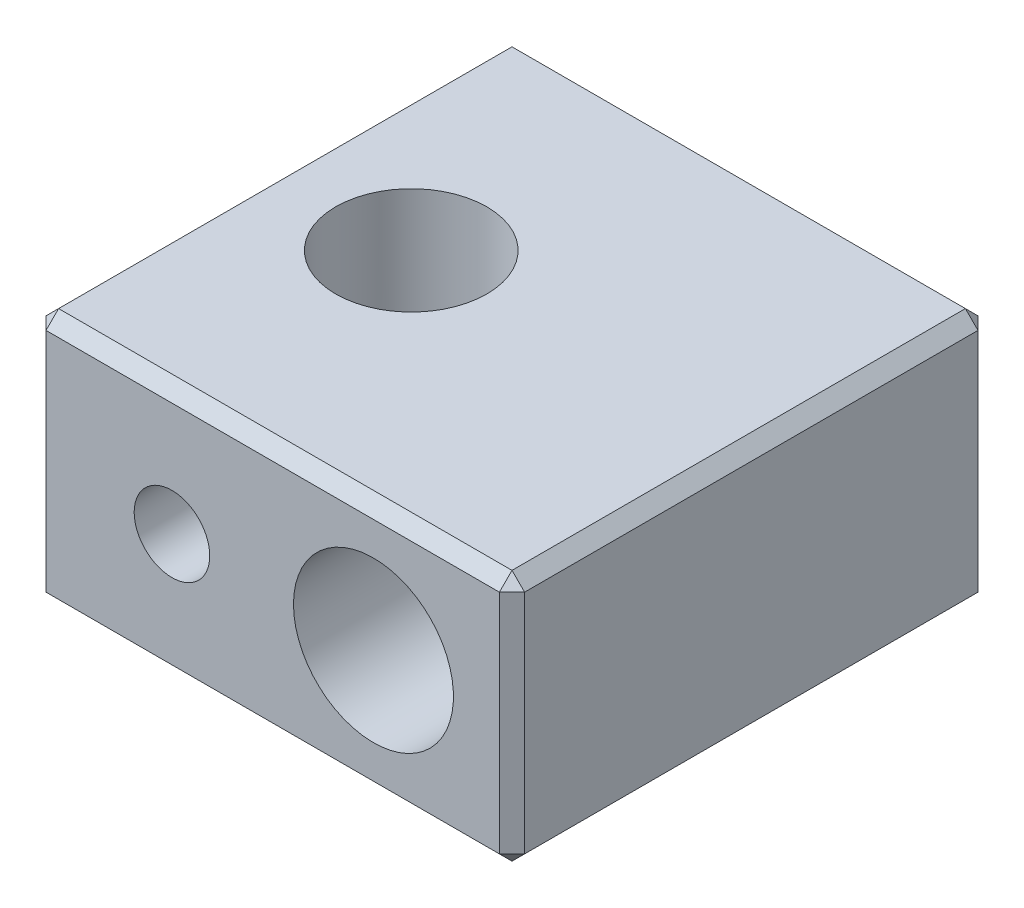
ISO-10303-21;
HEADER;
FILE_DESCRIPTION(('STEP AP214'),'2;1');
FILE_NAME('part.step','',(''),(''),'','','');
FILE_SCHEMA(('AUTOMOTIVE_DESIGN { 1 0 10303 214 1 1 1 1 }'));
ENDSEC;
DATA;
#1=APPLICATION_CONTEXT('core data for automotive mechanical design processes');
#2=APPLICATION_PROTOCOL_DEFINITION('international standard','automotive_design',2000,#1);
#3=PRODUCT_CONTEXT('',#1,'mechanical');
#4=PRODUCT('Part','Part','',(#3));
#5=PRODUCT_RELATED_PRODUCT_CATEGORY('part','',(#4));
#6=PRODUCT_DEFINITION_FORMATION('','',#4);
#7=PRODUCT_DEFINITION_CONTEXT('part definition',#1,'design');
#8=PRODUCT_DEFINITION('design','',#6,#7);
#9=PRODUCT_DEFINITION_SHAPE('','',#8);
#10=(LENGTH_UNIT() NAMED_UNIT(*) SI_UNIT(.MILLI.,.METRE.));
#11=(NAMED_UNIT(*) PLANE_ANGLE_UNIT() SI_UNIT($,.RADIAN.));
#12=(NAMED_UNIT(*) SI_UNIT($,.STERADIAN.) SOLID_ANGLE_UNIT());
#13=UNCERTAINTY_MEASURE_WITH_UNIT(LENGTH_MEASURE(1.E-05),#10,'distance_accuracy_value','');
#14=(GEOMETRIC_REPRESENTATION_CONTEXT(3) GLOBAL_UNCERTAINTY_ASSIGNED_CONTEXT((#13)) GLOBAL_UNIT_ASSIGNED_CONTEXT((#10,
#11,#12)) REPRESENTATION_CONTEXT('',''));
#15=CARTESIAN_POINT('',(0.,0.,0.));
#16=DIRECTION('',(0.,0.,1.));
#17=DIRECTION('',(1.,0.,0.));
#18=AXIS2_PLACEMENT_3D('',#15,#16,#17);
#19=CARTESIAN_POINT('',(-9.5,10.,9.5));
#20=DIRECTION('',(0.,0.,-1.));
#21=DIRECTION('',(-1.,0.,0.));
#22=AXIS2_PLACEMENT_3D('',#19,#20,#21);
#23=PLANE('',#22);
#24=DIRECTION('',(0.,-1.,0.));
#25=VECTOR('',#24,1.);
#26=CARTESIAN_POINT('',(-8.99999999999999,10.,9.5));
#27=LINE('',#26,#25);
#28=CARTESIAN_POINT('',(-8.99999999999999,9.49999999999999,9.5));
#29=VERTEX_POINT('',#28);
#30=CARTESIAN_POINT('',(-8.99999999999999,0.500000000000004,9.5));
#31=VERTEX_POINT('',#30);
#32=EDGE_CURVE('E133',#29,#31,#27,.T.);
#33=ORIENTED_EDGE('',*,*,#32,.T.);
#34=DIRECTION('',(1.,0.,0.));
#35=VECTOR('',#34,1.);
#36=CARTESIAN_POINT('',(-9.5,0.500000000000004,9.5));
#37=LINE('',#36,#35);
#38=CARTESIAN_POINT('',(8.99999999999999,0.500000000000004,9.5));
#39=VERTEX_POINT('',#38);
#40=EDGE_CURVE('E129',#31,#39,#37,.T.);
#41=ORIENTED_EDGE('',*,*,#40,.T.);
#42=DIRECTION('',(0.,1.,0.));
#43=VECTOR('',#42,1.);
#44=CARTESIAN_POINT('',(8.99999999999999,10.,9.5));
#45=LINE('',#44,#43);
#46=CARTESIAN_POINT('',(8.99999999999999,9.49999999999999,9.5));
#47=VERTEX_POINT('',#46);
#48=EDGE_CURVE('E123',#39,#47,#45,.T.);
#49=ORIENTED_EDGE('',*,*,#48,.T.);
#50=DIRECTION('',(-1.,0.,0.));
#51=VECTOR('',#50,1.);
#52=CARTESIAN_POINT('',(-9.5,9.49999999999999,9.5));
#53=LINE('',#52,#51);
#54=EDGE_CURVE('E126',#47,#29,#53,.T.);
#55=ORIENTED_EDGE('',*,*,#54,.T.);
#56=EDGE_LOOP('',(#33,#41,#49,#55));
#57=FACE_BOUND('',#56,.T.);
#58=CARTESIAN_POINT('',(4.,5.,9.5));
#59=DIRECTION('',(0.,0.,-1.));
#60=DIRECTION('',(-1.,0.,0.));
#61=AXIS2_PLACEMENT_3D('',#58,#59,#60);
#62=CIRCLE('',#61,3.175);
#63=CARTESIAN_POINT('',(0.824999999999998,5.,9.5));
#64=VERTEX_POINT('',#63);
#65=EDGE_CURVE('E226',#64,#64,#62,.T.);
#66=ORIENTED_EDGE('',*,*,#65,.T.);
#67=EDGE_LOOP('',(#66));
#68=FACE_BOUND('',#67,.T.);
#69=CARTESIAN_POINT('',(-4.,5.,9.5));
#70=DIRECTION('',(0.,0.,-1.));
#71=DIRECTION('',(-1.,0.,0.));
#72=AXIS2_PLACEMENT_3D('',#69,#70,#71);
#73=CIRCLE('',#72,1.5);
#74=CARTESIAN_POINT('',(-5.5,5.,9.5));
#75=VERTEX_POINT('',#74);
#76=EDGE_CURVE('E202',#75,#75,#73,.T.);
#77=ORIENTED_EDGE('',*,*,#76,.T.);
#78=EDGE_LOOP('',(#77));
#79=FACE_BOUND('',#78,.T.);
#80=ADVANCED_FACE('F35',(#57,#68,#79),#23,.F.);
#81=CARTESIAN_POINT('',(9.5,0.,9.5));
#82=DIRECTION('',(0.,1.,0.));
#83=DIRECTION('',(0.,0.,1.));
#84=AXIS2_PLACEMENT_3D('',#81,#82,#83);
#85=PLANE('',#84);
#86=DIRECTION('',(0.,0.,1.));
#87=VECTOR('',#86,1.);
#88=CARTESIAN_POINT('',(9.,0.,9.5));
#89=LINE('',#88,#87);
#90=CARTESIAN_POINT('',(8.99999999999999,0.,-8.99999999999999));
#91=VERTEX_POINT('',#90);
#92=CARTESIAN_POINT('',(9.,0.,8.99999999999999));
#93=VERTEX_POINT('',#92);
#94=EDGE_CURVE('E362',#91,#93,#89,.T.);
#95=ORIENTED_EDGE('',*,*,#94,.T.);
#96=DIRECTION('',(-1.,0.,0.));
#97=VECTOR('',#96,1.);
#98=CARTESIAN_POINT('',(9.5,0.,8.99999999999999));
#99=LINE('',#98,#97);
#100=CARTESIAN_POINT('',(-8.99999999999999,0.,8.99999999999999));
#101=VERTEX_POINT('',#100);
#102=EDGE_CURVE('E364',#93,#101,#99,.T.);
#103=ORIENTED_EDGE('',*,*,#102,.T.);
#104=DIRECTION('',(0.,0.,-1.));
#105=VECTOR('',#104,1.);
#106=CARTESIAN_POINT('',(-8.99999999999999,0.,9.5));
#107=LINE('',#106,#105);
#108=CARTESIAN_POINT('',(-8.99999999999999,0.,-8.99999999999999));
#109=VERTEX_POINT('',#108);
#110=EDGE_CURVE('E358',#101,#109,#107,.T.);
#111=ORIENTED_EDGE('',*,*,#110,.T.);
#112=DIRECTION('',(1.,0.,0.));
#113=VECTOR('',#112,1.);
#114=CARTESIAN_POINT('',(9.5,0.,-8.99999999999999));
#115=LINE('',#114,#113);
#116=EDGE_CURVE('E360',#109,#91,#115,.T.);
#117=ORIENTED_EDGE('',*,*,#116,.T.);
#118=EDGE_LOOP('',(#95,#103,#111,#117));
#119=FACE_BOUND('',#118,.T.);
#120=CARTESIAN_POINT('',(-4.,0.,0.));
#121=DIRECTION('',(0.,-1.,0.));
#122=DIRECTION('',(0.,0.,-1.));
#123=AXIS2_PLACEMENT_3D('',#120,#121,#122);
#124=CIRCLE('',#123,3.25);
#125=CARTESIAN_POINT('',(-4.,0.,-3.25));
#126=VERTEX_POINT('',#125);
#127=EDGE_CURVE('E428',#126,#126,#124,.T.);
#128=ORIENTED_EDGE('',*,*,#127,.F.);
#129=EDGE_LOOP('',(#128));
#130=FACE_BOUND('',#129,.T.);
#131=CARTESIAN_POINT('',(4.,0.,0.));
#132=DIRECTION('',(0.,1.,0.));
#133=DIRECTION('',(0.,0.,1.));
#134=AXIS2_PLACEMENT_3D('',#131,#132,#133);
#135=CIRCLE('',#134,1.5);
#136=CARTESIAN_POINT('',(4.,0.,1.5));
#137=VERTEX_POINT('',#136);
#138=EDGE_CURVE('E216',#137,#137,#135,.T.);
#139=ORIENTED_EDGE('',*,*,#138,.T.);
#140=EDGE_LOOP('',(#139));
#141=FACE_BOUND('',#140,.T.);
#142=ADVANCED_FACE('F247',(#119,#130,#141),#85,.F.);
#143=CARTESIAN_POINT('',(4.,5.,9.5));
#144=DIRECTION('',(0.,0.,-1.));
#145=DIRECTION('',(-1.,0.,0.));
#146=AXIS2_PLACEMENT_3D('',#143,#144,#145);
#147=CYLINDRICAL_SURFACE('',#146,3.175);
#148=CARTESIAN_POINT('',(4.,5.,-9.5));
#149=DIRECTION('',(0.,0.,-1.));
#150=DIRECTION('',(-1.,0.,0.));
#151=AXIS2_PLACEMENT_3D('',#148,#149,#150);
#152=CIRCLE('',#151,3.175);
#153=CARTESIAN_POINT('',(0.824999999999998,5.,-9.5));
#154=VERTEX_POINT('',#153);
#155=EDGE_CURVE('E219',#154,#154,#152,.T.);
#156=ORIENTED_EDGE('',*,*,#155,.T.);
#157=EDGE_LOOP('',(#156));
#158=FACE_BOUND('',#157,.T.);
#159=ORIENTED_EDGE('',*,*,#65,.F.);
#160=EDGE_LOOP('',(#159));
#161=FACE_BOUND('',#160,.T.);
#162=CARTESIAN_POINT('',(4.,1.825,-1.5));
#163=CARTESIAN_POINT('',(4.07936960563319,1.82500378014705,-1.49999552610351));
#164=CARTESIAN_POINT('',(4.15884896621332,1.82800879629186,-1.49366335348419));
#165=CARTESIAN_POINT('',(4.3154907966577,1.83973237257584,-1.46859961285751));
#166=CARTESIAN_POINT('',(4.39264787604167,1.84846329246751,-1.44984122112576));
#167=CARTESIAN_POINT('',(4.54213461401645,1.8707181485981,-1.40080463386028));
#168=CARTESIAN_POINT('',(4.61448113482697,1.88422416603307,-1.37056947468804));
#169=CARTESIAN_POINT('',(4.75298275747988,1.91476442442062,-1.29964446831745));
#170=CARTESIAN_POINT('',(4.81913879873701,1.93179812877659,-1.25895621091422));
#171=CARTESIAN_POINT('',(4.94753197755139,1.96890784997548,-1.16568662754687));
#172=CARTESIAN_POINT('',(5.00934531536299,1.98910050392611,-1.11256891765261));
#173=CARTESIAN_POINT('',(5.12356872804672,2.02983122248948,-0.997094015418057));
#174=CARTESIAN_POINT('',(5.17597245123061,2.05036951025994,-0.934730633511468));
#175=CARTESIAN_POINT('',(5.27340721108708,2.09104265788839,-0.797484364549707));
#176=CARTESIAN_POINT('',(5.31770529611402,2.11105747093378,-0.722041543144826));
#177=CARTESIAN_POINT('',(5.39279860497068,2.14649805086367,-0.563714506050773));
#178=CARTESIAN_POINT('',(5.4236026358555,2.16192680877126,-0.480835186570921));
#179=CARTESIAN_POINT('',(5.46896762087975,2.18515018476853,-0.31481732997647));
#180=CARTESIAN_POINT('',(5.48434942407678,2.19332754828801,-0.231959104586468));
#181=CARTESIAN_POINT('',(5.50096994970779,2.20217709352757,-0.0644666996695347));
#182=CARTESIAN_POINT('',(5.50222015512641,2.20285536881031,0.0201659819400645));
#183=CARTESIAN_POINT('',(5.49114871052963,2.19694406736192,0.179375308597733));
#184=CARTESIAN_POINT('',(5.48022366031689,2.19110228775897,0.254083159444344));
#185=CARTESIAN_POINT('',(5.44750469243097,2.17410342089286,0.400444680864749));
#186=CARTESIAN_POINT('',(5.42570787921159,2.16294491762807,0.472097532259387));
#187=CARTESIAN_POINT('',(5.37144042107046,2.13631288920667,0.612321457252151));
#188=CARTESIAN_POINT('',(5.33873421633754,2.12074539557425,0.680782693270601));
#189=CARTESIAN_POINT('',(5.26375034917989,2.08705518759843,0.811555770691812));
#190=CARTESIAN_POINT('',(5.22146847336964,2.06893134976761,0.873864887721362));
#191=CARTESIAN_POINT('',(5.12301829304094,2.02972032691525,0.997886017898578));
#192=CARTESIAN_POINT('',(5.06582685913967,2.00852815825586,1.05875534173549));
#193=CARTESIAN_POINT('',(4.94191165452174,1.96723030755263,1.17036692101214));
#194=CARTESIAN_POINT('',(4.87518424052315,1.94712504483319,1.22110528801275));
#195=CARTESIAN_POINT('',(4.73090045194253,1.90934186811578,1.31276553049459));
#196=CARTESIAN_POINT('',(4.65303276474939,1.89178262065809,1.3532501250906));
#197=CARTESIAN_POINT('',(4.49054980640997,1.86204103438622,1.42023485274128));
#198=CARTESIAN_POINT('',(4.40593938939462,1.84985486801759,1.44674494327945));
#199=CARTESIAN_POINT('',(4.23932533118367,1.83301150614484,1.48304672169946));
#200=CARTESIAN_POINT('',(4.15761808537237,1.82784930363547,1.49396302225133));
#201=CARTESIAN_POINT('',(3.99337993762666,1.82394625691096,1.50223450172528));
#202=CARTESIAN_POINT('',(3.91084937990857,1.82520283284867,1.49959512896601));
#203=CARTESIAN_POINT('',(3.75320909524375,1.83368749574601,1.48154104977407));
#204=CARTESIAN_POINT('',(3.67797438273671,1.84050696101403,1.46700031787886));
#205=CARTESIAN_POINT('',(3.53114008861237,1.85893750143806,1.42687253370616));
#206=CARTESIAN_POINT('',(3.45954092924452,1.87054913175455,1.40128420157562));
#207=CARTESIAN_POINT('',(3.3195173353867,1.89793370999513,1.33902722401946));
#208=CARTESIAN_POINT('',(3.25125556630968,1.91382242394619,1.30204540414419));
#209=CARTESIAN_POINT('',(3.12166658688653,1.9481715735434,1.21839457445117));
#210=CARTESIAN_POINT('',(3.06034243754656,1.9666331364222,1.17172131414348));
#211=CARTESIAN_POINT('',(2.94055528499526,2.00625152384082,1.06515983569381));
#212=CARTESIAN_POINT('',(2.88284178298482,2.02750159498701,1.00446196991745));
#213=CARTESIAN_POINT('',(2.77812417836031,2.0689892973599,0.874079956626705));
#214=CARTESIAN_POINT('',(2.73112556156511,2.08922640584945,0.804391234425825));
#215=CARTESIAN_POINT('',(2.6476822639998,2.1270157776171,0.654841394300249));
#216=CARTESIAN_POINT('',(2.6116642516864,2.14444936754207,0.574709723149408));
#217=CARTESIAN_POINT('',(2.55400203348932,2.17320495906616,0.408424263919081));
#218=CARTESIAN_POINT('',(2.53234145021053,2.18453392139114,0.322277461718732));
#219=CARTESIAN_POINT('',(2.50583444641473,2.19851851692831,0.154863402906991));
#220=CARTESIAN_POINT('',(2.49963251148815,2.20187207176707,0.0738695282686648));
#221=CARTESIAN_POINT('',(2.5004008875279,2.20145924129458,-0.0880256718279041));
#222=CARTESIAN_POINT('',(2.50736721668871,2.19769500825225,-0.168927017863447));
#223=CARTESIAN_POINT('',(2.53304452543146,2.1841789062617,-0.321861858166745));
#224=CARTESIAN_POINT('',(2.55081637100025,2.17490706922987,-0.394100315708995));
#225=CARTESIAN_POINT('',(2.59652737888882,2.15192341830404,-0.53452895410737));
#226=CARTESIAN_POINT('',(2.62446960003733,2.13821026878362,-0.6027179098565));
#227=CARTESIAN_POINT('',(2.69183834096165,2.10676566636447,-0.738110551829189));
#228=CARTESIAN_POINT('',(2.73190592465991,2.0888273778811,-0.804945969560304));
#229=CARTESIAN_POINT('',(2.82161930265931,2.05137218308055,-0.931360798184328));
#230=CARTESIAN_POINT('',(2.87126967655845,2.03185452458563,-0.990936717479633));
#231=CARTESIAN_POINT('',(2.98481054622897,1.99101051160812,-1.1075560784686));
#232=CARTESIAN_POINT('',(3.04964445909147,1.96970684763495,-1.16369381341707));
#233=CARTESIAN_POINT('',(3.18849355379877,1.92960939228646,-1.26444175427494));
#234=CARTESIAN_POINT('',(3.26251314986984,1.91081681670608,-1.30904638589811));
#235=CARTESIAN_POINT('',(3.41768967664033,1.87785196490441,-1.3850463197749));
#236=CARTESIAN_POINT('',(3.49882070475343,1.86366373894684,-1.41648733383919));
#237=CARTESIAN_POINT('',(3.66595879751047,1.84150449210771,-1.46490242402554));
#238=CARTESIAN_POINT('',(3.7519506429211,1.83351510637885,-1.48191924759625));
#239=CARTESIAN_POINT('',(3.86555067251037,1.82773333825557,-1.49420643339842));
#240=CARTESIAN_POINT('',(3.89238024918377,1.82671048291779,-1.49637655199677));
#241=CARTESIAN_POINT('',(3.94613566805403,1.82534316483504,-1.49927411038089));
#242=CARTESIAN_POINT('',(3.97306151235319,1.82499871699697,-1.50000151846547));
#243=CARTESIAN_POINT('',(4.,1.825,-1.5));
#244=B_SPLINE_CURVE_WITH_KNOTS('',3,(#162,#163,#164,#165,#166,#167,#168,#169,#170,#171,#172,
#173,#174,#175,#176,#177,#178,#179,#180,#181,#182,#183,#184,#185,#186,#187,#188,#189,#190,#191,
#192,#193,#194,#195,#196,#197,#198,#199,#200,#201,#202,#203,#204,#205,#206,#207,#208,#209,#210,
#211,#212,#213,#214,#215,#216,#217,#218,#219,#220,#221,#222,#223,#224,#225,#226,#227,#228,#229,
#230,#231,#232,#233,#234,#235,#236,#237,#238,#239,#240,#241,#242,#243),.UNSPECIFIED.,.T.,.F.,(4,
2,2,2,2,2,2,2,2,2,2,2,2,2,2,2,2,2,2,2,2,2,2,2,2,2,2,2,2,2,2,2,2,2,2,2,2,2,2,2,4),(0.,
0.237998863435127,0.476513162034361,0.714141760487185,0.951734239756924,1.202566267352,
1.45356698050229,1.72144991719773,1.98915775546694,2.24170968929963,2.4940563909499,
2.72018464462581,2.94637315667184,3.17780125644152,3.40933138528568,3.66670059385932,
3.92416839616743,4.19124985366182,4.45814074508092,4.70459764976704,4.9509555058397,
5.18069145066332,5.41045401730286,5.6472008989094,5.88405183355053,6.14213867221335,
6.40035735120202,6.66760822573517,6.93455372246492,7.17710763594646,7.41958821796887,
7.64352093670395,7.86752106087492,8.10644389425159,8.34548119240929,8.60934561245708,
8.87333732850241,9.13640455025375,9.39868939422999,9.47946576344206,9.56024390756228),.UNSPECIFIED.);
#245=CARTESIAN_POINT('',(4.,1.825,-1.5));
#246=VERTEX_POINT('',#245);
#247=EDGE_CURVE('E213',#246,#246,#244,.T.);
#248=ORIENTED_EDGE('',*,*,#247,.T.);
#249=EDGE_LOOP('',(#248));
#250=FACE_BOUND('',#249,.T.);
#251=ADVANCED_FACE('F252',(#158,#161,#250),#147,.F.);
#252=CARTESIAN_POINT('',(-4.,10.,0.));
#253=DIRECTION('',(0.,-1.,0.));
#254=DIRECTION('',(0.,0.,-1.));
#255=AXIS2_PLACEMENT_3D('',#252,#253,#254);
#256=CYLINDRICAL_SURFACE('',#255,3.);
#257=CARTESIAN_POINT('',(-4.,10.,0.));
#258=DIRECTION('',(0.,1.,0.));
#259=DIRECTION('',(0.,0.,1.));
#260=AXIS2_PLACEMENT_3D('',#257,#258,#259);
#261=CIRCLE('',#260,3.);
#262=CARTESIAN_POINT('',(-4.,10.,3.));
#263=VERTEX_POINT('',#262);
#264=EDGE_CURVE('E144',#263,#263,#261,.T.);
#265=ORIENTED_EDGE('',*,*,#264,.T.);
#266=EDGE_LOOP('',(#265));
#267=FACE_BOUND('',#266,.T.);
#268=CARTESIAN_POINT('',(-4.,1.5,0.));
#269=DIRECTION('',(0.,-1.,0.));
#270=DIRECTION('',(0.,0.,-1.));
#271=AXIS2_PLACEMENT_3D('',#268,#269,#270);
#272=CIRCLE('',#271,3.);
#273=CARTESIAN_POINT('',(-4.,1.5,-3.));
#274=VERTEX_POINT('',#273);
#275=EDGE_CURVE('E433',#274,#274,#272,.T.);
#276=ORIENTED_EDGE('',*,*,#275,.T.);
#277=EDGE_LOOP('',(#276));
#278=FACE_BOUND('',#277,.T.);
#279=ADVANCED_FACE('F440',(#267,#278),#256,.F.);
#280=CARTESIAN_POINT('',(9.5,10.,9.5));
#281=DIRECTION('',(0.,1.,0.));
#282=DIRECTION('',(0.,0.,1.));
#283=AXIS2_PLACEMENT_3D('',#280,#281,#282);
#284=PLANE('',#283);
#285=DIRECTION('',(0.,0.,-1.));
#286=VECTOR('',#285,1.);
#287=CARTESIAN_POINT('',(9.,10.,-9.5));
#288=LINE('',#287,#286);
#289=CARTESIAN_POINT('',(9.,10.,9.));
#290=VERTEX_POINT('',#289);
#291=CARTESIAN_POINT('',(9.,10.,-8.99999999999999));
#292=VERTEX_POINT('',#291);
#293=EDGE_CURVE('E44',#290,#292,#288,.T.);
#294=ORIENTED_EDGE('',*,*,#293,.T.);
#295=DIRECTION('',(-1.,0.,0.));
#296=VECTOR('',#295,1.);
#297=CARTESIAN_POINT('',(-9.5,10.,-8.99999999999999));
#298=LINE('',#297,#296);
#299=CARTESIAN_POINT('',(-8.99999999999999,10.,-8.99999999999999));
#300=VERTEX_POINT('',#299);
#301=EDGE_CURVE('E11',#292,#300,#298,.T.);
#302=ORIENTED_EDGE('',*,*,#301,.T.);
#303=DIRECTION('',(0.,0.,1.));
#304=VECTOR('',#303,1.);
#305=CARTESIAN_POINT('',(-8.99999999999999,10.,9.5));
#306=LINE('',#305,#304);
#307=CARTESIAN_POINT('',(-8.99999999999999,10.,9.));
#308=VERTEX_POINT('',#307);
#309=EDGE_CURVE('E343',#300,#308,#306,.T.);
#310=ORIENTED_EDGE('',*,*,#309,.T.);
#311=DIRECTION('',(1.,0.,0.));
#312=VECTOR('',#311,1.);
#313=CARTESIAN_POINT('',(9.5,10.,9.));
#314=LINE('',#313,#312);
#315=EDGE_CURVE('E55',#308,#290,#314,.T.);
#316=ORIENTED_EDGE('',*,*,#315,.T.);
#317=EDGE_LOOP('',(#294,#302,#310,#316));
#318=FACE_BOUND('',#317,.T.);
#319=ORIENTED_EDGE('',*,*,#264,.F.);
#320=EDGE_LOOP('',(#319));
#321=FACE_BOUND('',#320,.T.);
#322=ADVANCED_FACE('F269',(#318,#321),#284,.T.);
#323=CARTESIAN_POINT('',(9.5,10.,-9.5));
#324=DIRECTION('',(-1.,0.,0.));
#325=DIRECTION('',(0.,0.,1.));
#326=AXIS2_PLACEMENT_3D('',#323,#324,#325);
#327=PLANE('',#326);
#328=DIRECTION('',(0.,-1.,0.));
#329=VECTOR('',#328,1.);
#330=CARTESIAN_POINT('',(9.5,10.,9.));
#331=LINE('',#330,#329);
#332=CARTESIAN_POINT('',(9.5,9.49999999999999,9.));
#333=VERTEX_POINT('',#332);
#334=CARTESIAN_POINT('',(9.5,0.500000000000004,9.));
#335=VERTEX_POINT('',#334);
#336=EDGE_CURVE('E155',#333,#335,#331,.T.);
#337=ORIENTED_EDGE('',*,*,#336,.T.);
#338=DIRECTION('',(0.,0.,-1.));
#339=VECTOR('',#338,1.);
#340=CARTESIAN_POINT('',(9.5,0.500000000000004,-9.5));
#341=LINE('',#340,#339);
#342=CARTESIAN_POINT('',(9.5,0.500000000000004,-8.99999999999999));
#343=VERTEX_POINT('',#342);
#344=EDGE_CURVE('E372',#335,#343,#341,.T.);
#345=ORIENTED_EDGE('',*,*,#344,.T.);
#346=DIRECTION('',(0.,1.,0.));
#347=VECTOR('',#346,1.);
#348=CARTESIAN_POINT('',(9.5,10.,-8.99999999999999));
#349=LINE('',#348,#347);
#350=CARTESIAN_POINT('',(9.5,9.49999999999999,-8.99999999999999));
#351=VERTEX_POINT('',#350);
#352=EDGE_CURVE('E370',#343,#351,#349,.T.);
#353=ORIENTED_EDGE('',*,*,#352,.T.);
#354=DIRECTION('',(0.,0.,1.));
#355=VECTOR('',#354,1.);
#356=CARTESIAN_POINT('',(9.5,9.49999999999999,9.5));
#357=LINE('',#356,#355);
#358=EDGE_CURVE('E367',#351,#333,#357,.T.);
#359=ORIENTED_EDGE('',*,*,#358,.T.);
#360=EDGE_LOOP('',(#337,#345,#353,#359));
#361=FACE_BOUND('',#360,.T.);
#362=ADVANCED_FACE('F265',(#361),#327,.F.);
#363=CARTESIAN_POINT('',(-9.5,10.,-9.5));
#364=DIRECTION('',(0.,0.,1.));
#365=DIRECTION('',(1.,0.,0.));
#366=AXIS2_PLACEMENT_3D('',#363,#364,#365);
#367=PLANE('',#366);
#368=DIRECTION('',(0.,-1.,0.));
#369=VECTOR('',#368,1.);
#370=CARTESIAN_POINT('',(9.,10.,-9.5));
#371=LINE('',#370,#369);
#372=CARTESIAN_POINT('',(9.,9.49999999999999,-9.5));
#373=VERTEX_POINT('',#372);
#374=CARTESIAN_POINT('',(9.,0.500000000000004,-9.5));
#375=VERTEX_POINT('',#374);
#376=EDGE_CURVE('E376',#373,#375,#371,.T.);
#377=ORIENTED_EDGE('',*,*,#376,.T.);
#378=DIRECTION('',(-1.,0.,0.));
#379=VECTOR('',#378,1.);
#380=CARTESIAN_POINT('',(-9.5,0.500000000000004,-9.5));
#381=LINE('',#380,#379);
#382=CARTESIAN_POINT('',(-9.,0.500000000000004,-9.5));
#383=VERTEX_POINT('',#382);
#384=EDGE_CURVE('E380',#375,#383,#381,.T.);
#385=ORIENTED_EDGE('',*,*,#384,.T.);
#386=DIRECTION('',(0.,1.,0.));
#387=VECTOR('',#386,1.);
#388=CARTESIAN_POINT('',(-9.,10.,-9.5));
#389=LINE('',#388,#387);
#390=CARTESIAN_POINT('',(-9.,9.49999999999999,-9.5));
#391=VERTEX_POINT('',#390);
#392=EDGE_CURVE('E378',#383,#391,#389,.T.);
#393=ORIENTED_EDGE('',*,*,#392,.T.);
#394=DIRECTION('',(1.,0.,0.));
#395=VECTOR('',#394,1.);
#396=CARTESIAN_POINT('',(9.5,9.49999999999999,-9.5));
#397=LINE('',#396,#395);
#398=EDGE_CURVE('E341',#391,#373,#397,.T.);
#399=ORIENTED_EDGE('',*,*,#398,.T.);
#400=EDGE_LOOP('',(#377,#385,#393,#399));
#401=FACE_BOUND('',#400,.T.);
#402=ORIENTED_EDGE('',*,*,#155,.F.);
#403=EDGE_LOOP('',(#402));
#404=FACE_BOUND('',#403,.T.);
#405=ADVANCED_FACE('F261',(#401,#404),#367,.F.);
#406=CARTESIAN_POINT('',(-9.5,10.,-9.5));
#407=DIRECTION('',(1.,0.,0.));
#408=DIRECTION('',(0.,0.,-1.));
#409=AXIS2_PLACEMENT_3D('',#406,#407,#408);
#410=PLANE('',#409);
#411=DIRECTION('',(0.,-1.,0.));
#412=VECTOR('',#411,1.);
#413=CARTESIAN_POINT('',(-9.5,10.,-8.99999999999999));
#414=LINE('',#413,#412);
#415=CARTESIAN_POINT('',(-9.5,9.49999999999999,-8.99999999999999));
#416=VERTEX_POINT('',#415);
#417=CARTESIAN_POINT('',(-9.5,0.500000000000007,-8.99999999999999));
#418=VERTEX_POINT('',#417);
#419=EDGE_CURVE('E386',#416,#418,#414,.T.);
#420=ORIENTED_EDGE('',*,*,#419,.T.);
#421=DIRECTION('',(0.,0.,1.));
#422=VECTOR('',#421,1.);
#423=CARTESIAN_POINT('',(-9.5,0.500000000000007,-9.5));
#424=LINE('',#423,#422);
#425=CARTESIAN_POINT('',(-9.5,0.500000000000007,8.99999999999999));
#426=VERTEX_POINT('',#425);
#427=EDGE_CURVE('E345',#418,#426,#424,.T.);
#428=ORIENTED_EDGE('',*,*,#427,.T.);
#429=DIRECTION('',(0.,1.,0.));
#430=VECTOR('',#429,1.);
#431=CARTESIAN_POINT('',(-9.5,10.,8.99999999999999));
#432=LINE('',#431,#430);
#433=CARTESIAN_POINT('',(-9.5,9.49999999999999,8.99999999999999));
#434=VERTEX_POINT('',#433);
#435=EDGE_CURVE('E384',#426,#434,#432,.T.);
#436=ORIENTED_EDGE('',*,*,#435,.T.);
#437=DIRECTION('',(0.,0.,-1.));
#438=VECTOR('',#437,1.);
#439=CARTESIAN_POINT('',(-9.5,9.49999999999999,-9.5));
#440=LINE('',#439,#438);
#441=EDGE_CURVE('E348',#434,#416,#440,.T.);
#442=ORIENTED_EDGE('',*,*,#441,.T.);
#443=EDGE_LOOP('',(#420,#428,#436,#442));
#444=FACE_BOUND('',#443,.T.);
#445=ADVANCED_FACE('F257',(#444),#410,.F.);
#446=CARTESIAN_POINT('',(-4.,1.5,0.));
#447=DIRECTION('',(0.,-1.,0.));
#448=DIRECTION('',(0.,0.,-1.));
#449=AXIS2_PLACEMENT_3D('',#446,#447,#448);
#450=CYLINDRICAL_SURFACE('',#449,3.25);
#451=CARTESIAN_POINT('',(-4.,1.5,0.));
#452=DIRECTION('',(0.,-1.,0.));
#453=DIRECTION('',(0.,0.,-1.));
#454=AXIS2_PLACEMENT_3D('',#451,#452,#453);
#455=CIRCLE('',#454,3.25);
#456=CARTESIAN_POINT('',(-4.,1.5,-3.25));
#457=VERTEX_POINT('',#456);
#458=EDGE_CURVE('E430',#457,#457,#455,.T.);
#459=ORIENTED_EDGE('',*,*,#458,.F.);
#460=EDGE_LOOP('',(#459));
#461=FACE_BOUND('',#460,.T.);
#462=ORIENTED_EDGE('',*,*,#127,.T.);
#463=EDGE_LOOP('',(#462));
#464=FACE_BOUND('',#463,.T.);
#465=ADVANCED_FACE('F260',(#461,#464),#450,.F.);
#466=CARTESIAN_POINT('',(-4.,1.5,0.));
#467=DIRECTION('',(0.,-1.,0.));
#468=DIRECTION('',(0.,0.,-1.));
#469=AXIS2_PLACEMENT_3D('',#466,#467,#468);
#470=PLANE('',#469);
#471=ORIENTED_EDGE('',*,*,#275,.F.);
#472=EDGE_LOOP('',(#471));
#473=FACE_BOUND('',#472,.T.);
#474=ORIENTED_EDGE('',*,*,#458,.T.);
#475=EDGE_LOOP('',(#474));
#476=FACE_BOUND('',#475,.T.);
#477=ADVANCED_FACE('F442',(#473,#476),#470,.T.);
#478=CARTESIAN_POINT('',(4.,10.001,0.));
#479=DIRECTION('',(0.,-1.,0.));
#480=DIRECTION('',(0.,0.,-1.));
#481=AXIS2_PLACEMENT_3D('',#478,#479,#480);
#482=CYLINDRICAL_SURFACE('',#481,1.5);
#483=ORIENTED_EDGE('',*,*,#138,.F.);
#484=EDGE_LOOP('',(#483));
#485=FACE_BOUND('',#484,.T.);
#486=ORIENTED_EDGE('',*,*,#247,.F.);
#487=EDGE_LOOP('',(#486));
#488=FACE_BOUND('',#487,.T.);
#489=ADVANCED_FACE('F228',(#485,#488),#482,.F.);
#490=CARTESIAN_POINT('',(-4.,5.,4.5));
#491=DIRECTION('',(0.,0.,1.));
#492=DIRECTION('',(1.,0.,0.));
#493=AXIS2_PLACEMENT_3D('',#490,#491,#492);
#494=CYLINDRICAL_SURFACE('',#493,1.5);
#495=CARTESIAN_POINT('',(-4.,5.,4.5));
#496=DIRECTION('',(0.,0.,-1.));
#497=DIRECTION('',(-1.,0.,0.));
#498=AXIS2_PLACEMENT_3D('',#495,#496,#497);
#499=CIRCLE('',#498,1.5);
#500=CARTESIAN_POINT('',(-5.5,5.,4.5));
#501=VERTEX_POINT('',#500);
#502=EDGE_CURVE('E208',#501,#501,#499,.T.);
#503=ORIENTED_EDGE('',*,*,#502,.T.);
#504=EDGE_LOOP('',(#503));
#505=FACE_BOUND('',#504,.T.);
#506=ORIENTED_EDGE('',*,*,#76,.F.);
#507=EDGE_LOOP('',(#506));
#508=FACE_BOUND('',#507,.T.);
#509=ADVANCED_FACE('F233',(#505,#508),#494,.F.);
#510=CARTESIAN_POINT('',(-4.,5.,4.5));
#511=DIRECTION('',(0.,0.,-1.));
#512=DIRECTION('',(-1.,0.,0.));
#513=AXIS2_PLACEMENT_3D('',#510,#511,#512);
#514=PLANE('',#513);
#515=ORIENTED_EDGE('',*,*,#502,.F.);
#516=EDGE_LOOP('',(#515));
#517=FACE_BOUND('',#516,.T.);
#518=ADVANCED_FACE('F236',(#517),#514,.F.);
#519=CARTESIAN_POINT('',(9.5,10.,-8.99999999999999));
#520=DIRECTION('',(0.,0.707106781186546,-0.707106781186549));
#521=DIRECTION('',(0.,0.707106781186549,0.707106781186546));
#522=AXIS2_PLACEMENT_3D('',#519,#520,#521);
#523=PLANE('',#522);
#524=DIRECTION('',(0.,-0.707106781186549,-0.707106781186546));
#525=VECTOR('',#524,1.);
#526=CARTESIAN_POINT('',(-9.,9.49999999999999,-9.5));
#527=LINE('',#526,#525);
#528=EDGE_CURVE('E39',#300,#391,#527,.T.);
#529=ORIENTED_EDGE('',*,*,#528,.F.);
#530=ORIENTED_EDGE('',*,*,#301,.F.);
#531=DIRECTION('',(0.,0.707106781186549,0.707106781186546));
#532=VECTOR('',#531,1.);
#533=CARTESIAN_POINT('',(9.,9.75,-9.24999999999999));
#534=LINE('',#533,#532);
#535=EDGE_CURVE('E195',#373,#292,#534,.T.);
#536=ORIENTED_EDGE('',*,*,#535,.F.);
#537=ORIENTED_EDGE('',*,*,#398,.F.);
#538=EDGE_LOOP('',(#529,#530,#536,#537));
#539=FACE_BOUND('',#538,.T.);
#540=ADVANCED_FACE('F37',(#539),#523,.T.);
#541=CARTESIAN_POINT('',(-9.,9.49999999999999,-9.5));
#542=DIRECTION('',(-0.577350269189628,0.577350269189626,-0.577350269189624));
#543=DIRECTION('',(-0.707106781186546,-0.707106781186549,0.));
#544=AXIS2_PLACEMENT_3D('',#541,#542,#543);
#545=PLANE('',#544);
#546=DIRECTION('',(0.707106781186548,0.707106781186548,0.));
#547=VECTOR('',#546,1.);
#548=CARTESIAN_POINT('',(-9.25,9.75,-8.99999999999999));
#549=LINE('',#548,#547);
#550=EDGE_CURVE('E190',#300,#416,#549,.F.);
#551=ORIENTED_EDGE('',*,*,#550,.F.);
#552=ORIENTED_EDGE('',*,*,#528,.T.);
#553=DIRECTION('',(0.707106781186545,0.,-0.70710678118655));
#554=VECTOR('',#553,1.);
#555=CARTESIAN_POINT('',(-9.,9.49999999999999,-9.5));
#556=LINE('',#555,#554);
#557=EDGE_CURVE('E193',#416,#391,#556,.T.);
#558=ORIENTED_EDGE('',*,*,#557,.F.);
#559=EDGE_LOOP('',(#551,#552,#558));
#560=FACE_BOUND('',#559,.T.);
#561=ADVANCED_FACE('F243',(#560),#545,.T.);
#562=CARTESIAN_POINT('',(9.5,9.49999999999999,-8.99999999999999));
#563=DIRECTION('',(0.57735026918963,0.577350269189622,-0.577350269189626));
#564=DIRECTION('',(-0.707106781186545,0.,-0.70710678118655));
#565=AXIS2_PLACEMENT_3D('',#562,#563,#564);
#566=PLANE('',#565);
#567=DIRECTION('',(0.707106781186545,0.,0.70710678118655));
#568=VECTOR('',#567,1.);
#569=CARTESIAN_POINT('',(9.5,9.49999999999999,-8.99999999999999));
#570=LINE('',#569,#568);
#571=EDGE_CURVE('E184',#373,#351,#570,.T.);
#572=ORIENTED_EDGE('',*,*,#571,.F.);
#573=ORIENTED_EDGE('',*,*,#535,.T.);
#574=DIRECTION('',(0.707106781186544,-0.707106781186551,0.));
#575=VECTOR('',#574,1.);
#576=CARTESIAN_POINT('',(9.5,9.49999999999999,-8.99999999999999));
#577=LINE('',#576,#575);
#578=EDGE_CURVE('E187',#351,#292,#577,.F.);
#579=ORIENTED_EDGE('',*,*,#578,.F.);
#580=EDGE_LOOP('',(#572,#573,#579));
#581=FACE_BOUND('',#580,.T.);
#582=ADVANCED_FACE('F332',(#581),#566,.T.);
#583=CARTESIAN_POINT('',(-9.5,10.,-8.99999999999999));
#584=DIRECTION('',(0.70710678118655,0.,0.707106781186545));
#585=DIRECTION('',(0.707106781186545,0.,-0.70710678118655));
#586=AXIS2_PLACEMENT_3D('',#583,#584,#585);
#587=PLANE('',#586);
#588=ORIENTED_EDGE('',*,*,#557,.T.);
#589=ORIENTED_EDGE('',*,*,#392,.F.);
#590=DIRECTION('',(-0.707106781186545,0.,0.70710678118655));
#591=VECTOR('',#590,1.);
#592=CARTESIAN_POINT('',(-9.,0.500000000000004,-9.5));
#593=LINE('',#592,#591);
#594=EDGE_CURVE('E179',#418,#383,#593,.F.);
#595=ORIENTED_EDGE('',*,*,#594,.F.);
#596=ORIENTED_EDGE('',*,*,#419,.F.);
#597=EDGE_LOOP('',(#588,#589,#595,#596));
#598=FACE_BOUND('',#597,.T.);
#599=ADVANCED_FACE('F328',(#598),#587,.F.);
#600=CARTESIAN_POINT('',(-8.99999999999999,10.,9.5));
#601=DIRECTION('',(-0.707106781186547,0.707106781186547,0.));
#602=DIRECTION('',(-0.707106781186548,-0.707106781186548,0.));
#603=AXIS2_PLACEMENT_3D('',#600,#601,#602);
#604=PLANE('',#603);
#605=ORIENTED_EDGE('',*,*,#550,.T.);
#606=ORIENTED_EDGE('',*,*,#441,.F.);
#607=DIRECTION('',(-0.707106781186547,-0.707106781186547,0.));
#608=VECTOR('',#607,1.);
#609=CARTESIAN_POINT('',(-9.5,9.49999999999999,8.99999999999999));
#610=LINE('',#609,#608);
#611=EDGE_CURVE('E176',#308,#434,#610,.T.);
#612=ORIENTED_EDGE('',*,*,#611,.F.);
#613=ORIENTED_EDGE('',*,*,#309,.F.);
#614=EDGE_LOOP('',(#605,#606,#612,#613));
#615=FACE_BOUND('',#614,.T.);
#616=ADVANCED_FACE('F325',(#615),#604,.T.);
#617=CARTESIAN_POINT('',(9.5,10.,9.));
#618=DIRECTION('',(0.,0.707106781186545,0.70710678118655));
#619=DIRECTION('',(0.,-0.70710678118655,0.707106781186545));
#620=AXIS2_PLACEMENT_3D('',#617,#618,#619);
#621=PLANE('',#620);
#622=DIRECTION('',(0.,-0.70710678118655,0.707106781186545));
#623=VECTOR('',#622,1.);
#624=CARTESIAN_POINT('',(8.99999999999999,9.49999999999999,9.5));
#625=LINE('',#624,#623);
#626=EDGE_CURVE('E139',#290,#47,#625,.T.);
#627=ORIENTED_EDGE('',*,*,#626,.F.);
#628=ORIENTED_EDGE('',*,*,#315,.F.);
#629=DIRECTION('',(0.,0.70710678118655,-0.707106781186545));
#630=VECTOR('',#629,1.);
#631=CARTESIAN_POINT('',(-8.99999999999999,9.74999999999999,9.25));
#632=LINE('',#631,#630);
#633=EDGE_CURVE('E142',#29,#308,#632,.T.);
#634=ORIENTED_EDGE('',*,*,#633,.F.);
#635=ORIENTED_EDGE('',*,*,#54,.F.);
#636=EDGE_LOOP('',(#627,#628,#634,#635));
#637=FACE_BOUND('',#636,.T.);
#638=ADVANCED_FACE('F138',(#637),#621,.T.);
#639=CARTESIAN_POINT('',(9.,10.,9.5));
#640=DIRECTION('',(0.707106781186551,0.707106781186544,0.));
#641=DIRECTION('',(-0.707106781186544,0.707106781186551,0.));
#642=AXIS2_PLACEMENT_3D('',#639,#640,#641);
#643=PLANE('',#642);
#644=ORIENTED_EDGE('',*,*,#578,.T.);
#645=ORIENTED_EDGE('',*,*,#293,.F.);
#646=DIRECTION('',(-0.707106781186544,0.707106781186551,0.));
#647=VECTOR('',#646,1.);
#648=CARTESIAN_POINT('',(9.25,9.75,9.));
#649=LINE('',#648,#647);
#650=EDGE_CURVE('E152',#333,#290,#649,.T.);
#651=ORIENTED_EDGE('',*,*,#650,.F.);
#652=ORIENTED_EDGE('',*,*,#358,.F.);
#653=EDGE_LOOP('',(#644,#645,#651,#652));
#654=FACE_BOUND('',#653,.T.);
#655=ADVANCED_FACE('F318',(#654),#643,.T.);
#656=CARTESIAN_POINT('',(9.,10.,-9.5));
#657=DIRECTION('',(-0.70710678118655,0.,0.707106781186545));
#658=DIRECTION('',(0.707106781186545,0.,0.70710678118655));
#659=AXIS2_PLACEMENT_3D('',#656,#657,#658);
#660=PLANE('',#659);
#661=ORIENTED_EDGE('',*,*,#571,.T.);
#662=ORIENTED_EDGE('',*,*,#352,.F.);
#663=DIRECTION('',(-0.707106781186545,0.,-0.70710678118655));
#664=VECTOR('',#663,1.);
#665=CARTESIAN_POINT('',(9.5,0.500000000000004,-8.99999999999999));
#666=LINE('',#665,#664);
#667=EDGE_CURVE('E171',#375,#343,#666,.F.);
#668=ORIENTED_EDGE('',*,*,#667,.F.);
#669=ORIENTED_EDGE('',*,*,#376,.F.);
#670=EDGE_LOOP('',(#661,#662,#668,#669));
#671=FACE_BOUND('',#670,.T.);
#672=ADVANCED_FACE('F314',(#671),#660,.F.);
#673=CARTESIAN_POINT('',(-9.5,0.500000000000004,-9.5));
#674=DIRECTION('',(0.,0.707106781186554,0.707106781186541));
#675=DIRECTION('',(0.,-0.707106781186541,0.707106781186554));
#676=AXIS2_PLACEMENT_3D('',#673,#674,#675);
#677=PLANE('',#676);
#678=DIRECTION('',(0.,0.707106781186541,-0.707106781186554));
#679=VECTOR('',#678,1.);
#680=CARTESIAN_POINT('',(-9.,0.500000000000004,-9.5));
#681=LINE('',#680,#679);
#682=EDGE_CURVE('E181',#383,#109,#681,.F.);
#683=ORIENTED_EDGE('',*,*,#682,.F.);
#684=ORIENTED_EDGE('',*,*,#384,.F.);
#685=DIRECTION('',(0.,-0.707106781186541,0.707106781186554));
#686=VECTOR('',#685,1.);
#687=CARTESIAN_POINT('',(9.,0.250000000000001,-9.24999999999999));
#688=LINE('',#687,#686);
#689=EDGE_CURVE('E168',#91,#375,#688,.F.);
#690=ORIENTED_EDGE('',*,*,#689,.F.);
#691=ORIENTED_EDGE('',*,*,#116,.F.);
#692=EDGE_LOOP('',(#683,#684,#690,#691));
#693=FACE_BOUND('',#692,.T.);
#694=ADVANCED_FACE('F310',(#693),#677,.F.);
#695=CARTESIAN_POINT('',(-9.,0.500000000000004,-9.5));
#696=DIRECTION('',(-0.577350269189626,-0.577350269189632,-0.577350269189618));
#697=DIRECTION('',(0.707106781186551,-0.707106781186544,0.));
#698=AXIS2_PLACEMENT_3D('',#695,#696,#697);
#699=PLANE('',#698);
#700=ORIENTED_EDGE('',*,*,#594,.T.);
#701=ORIENTED_EDGE('',*,*,#682,.T.);
#702=DIRECTION('',(0.707106781186548,-0.707106781186548,0.));
#703=VECTOR('',#702,1.);
#704=CARTESIAN_POINT('',(-9.25,0.250000000000006,-8.99999999999999));
#705=LINE('',#704,#703);
#706=EDGE_CURVE('E160',#418,#109,#705,.T.);
#707=ORIENTED_EDGE('',*,*,#706,.F.);
#708=EDGE_LOOP('',(#700,#701,#707));
#709=FACE_BOUND('',#708,.T.);
#710=ADVANCED_FACE('F306',(#709),#699,.T.);
#711=CARTESIAN_POINT('',(-9.5,9.49999999999999,8.99999999999999));
#712=DIRECTION('',(-0.577350269189628,0.577350269189624,0.577350269189624));
#713=DIRECTION('',(0.707106781186545,0.,0.70710678118655));
#714=AXIS2_PLACEMENT_3D('',#711,#712,#713);
#715=PLANE('',#714);
#716=ORIENTED_EDGE('',*,*,#633,.T.);
#717=ORIENTED_EDGE('',*,*,#611,.T.);
#718=DIRECTION('',(-0.707106781186545,0.,-0.70710678118655));
#719=VECTOR('',#718,1.);
#720=CARTESIAN_POINT('',(-9.5,9.49999999999999,8.99999999999999));
#721=LINE('',#720,#719);
#722=EDGE_CURVE('E156',#29,#434,#721,.T.);
#723=ORIENTED_EDGE('',*,*,#722,.F.);
#724=EDGE_LOOP('',(#716,#717,#723));
#725=FACE_BOUND('',#724,.T.);
#726=ADVANCED_FACE('F303',(#725),#715,.T.);
#727=CARTESIAN_POINT('',(8.99999999999999,9.49999999999999,9.5));
#728=DIRECTION('',(0.577350269189624,0.57735026918962,0.577350269189634));
#729=DIRECTION('',(0.707106781186554,0.,-0.707106781186541));
#730=AXIS2_PLACEMENT_3D('',#727,#728,#729);
#731=PLANE('',#730);
#732=ORIENTED_EDGE('',*,*,#650,.T.);
#733=ORIENTED_EDGE('',*,*,#626,.T.);
#734=DIRECTION('',(-0.707106781186554,0.,0.707106781186541));
#735=VECTOR('',#734,1.);
#736=CARTESIAN_POINT('',(8.99999999999999,9.49999999999999,9.5));
#737=LINE('',#736,#735);
#738=EDGE_CURVE('E149',#333,#47,#737,.T.);
#739=ORIENTED_EDGE('',*,*,#738,.F.);
#740=EDGE_LOOP('',(#732,#733,#739));
#741=FACE_BOUND('',#740,.T.);
#742=ADVANCED_FACE('F148',(#741),#731,.T.);
#743=CARTESIAN_POINT('',(9.5,0.500000000000004,-8.99999999999999));
#744=DIRECTION('',(0.577350269189625,-0.577350269189632,-0.57735026918962));
#745=DIRECTION('',(0.707106781186552,0.707106781186543,0.));
#746=AXIS2_PLACEMENT_3D('',#743,#744,#745);
#747=PLANE('',#746);
#748=ORIENTED_EDGE('',*,*,#689,.T.);
#749=ORIENTED_EDGE('',*,*,#667,.T.);
#750=DIRECTION('',(0.707106781186549,0.707106781186546,0.));
#751=VECTOR('',#750,1.);
#752=CARTESIAN_POINT('',(9.5,0.500000000000004,-8.99999999999999));
#753=LINE('',#752,#751);
#754=EDGE_CURVE('E157',#91,#343,#753,.T.);
#755=ORIENTED_EDGE('',*,*,#754,.F.);
#756=EDGE_LOOP('',(#748,#749,#755));
#757=FACE_BOUND('',#756,.T.);
#758=ADVANCED_FACE('F296',(#757),#747,.T.);
#759=CARTESIAN_POINT('',(-9.5,0.500000000000007,-9.5));
#760=DIRECTION('',(0.707106781186547,0.707106781186547,0.));
#761=DIRECTION('',(-0.707106781186548,0.707106781186548,0.));
#762=AXIS2_PLACEMENT_3D('',#759,#760,#761);
#763=PLANE('',#762);
#764=ORIENTED_EDGE('',*,*,#706,.T.);
#765=ORIENTED_EDGE('',*,*,#110,.F.);
#766=DIRECTION('',(-0.707106781186548,0.707106781186548,0.));
#767=VECTOR('',#766,1.);
#768=CARTESIAN_POINT('',(-8.99999999999999,0.,8.99999999999999));
#769=LINE('',#768,#767);
#770=EDGE_CURVE('E162',#426,#101,#769,.F.);
#771=ORIENTED_EDGE('',*,*,#770,.F.);
#772=ORIENTED_EDGE('',*,*,#427,.F.);
#773=EDGE_LOOP('',(#764,#765,#771,#772));
#774=FACE_BOUND('',#773,.T.);
#775=ADVANCED_FACE('F292',(#774),#763,.F.);
#776=CARTESIAN_POINT('',(-8.99999999999999,10.,9.5));
#777=DIRECTION('',(0.70710678118655,0.,-0.707106781186545));
#778=DIRECTION('',(-0.707106781186545,0.,-0.70710678118655));
#779=AXIS2_PLACEMENT_3D('',#776,#777,#778);
#780=PLANE('',#779);
#781=ORIENTED_EDGE('',*,*,#722,.T.);
#782=ORIENTED_EDGE('',*,*,#435,.F.);
#783=DIRECTION('',(0.707106781186545,0.,0.70710678118655));
#784=VECTOR('',#783,1.);
#785=CARTESIAN_POINT('',(-9.24999999999999,0.500000000000006,9.25));
#786=LINE('',#785,#784);
#787=EDGE_CURVE('E352',#31,#426,#786,.F.);
#788=ORIENTED_EDGE('',*,*,#787,.F.);
#789=ORIENTED_EDGE('',*,*,#32,.F.);
#790=EDGE_LOOP('',(#781,#782,#788,#789));
#791=FACE_BOUND('',#790,.T.);
#792=ADVANCED_FACE('F289',(#791),#780,.F.);
#793=CARTESIAN_POINT('',(9.5,10.,9.));
#794=DIRECTION('',(-0.707106781186541,0.,-0.707106781186554));
#795=DIRECTION('',(-0.707106781186554,0.,0.707106781186541));
#796=AXIS2_PLACEMENT_3D('',#793,#794,#795);
#797=PLANE('',#796);
#798=ORIENTED_EDGE('',*,*,#738,.T.);
#799=ORIENTED_EDGE('',*,*,#48,.F.);
#800=DIRECTION('',(0.707106781186554,0.,-0.707106781186541));
#801=VECTOR('',#800,1.);
#802=CARTESIAN_POINT('',(8.99999999999999,0.500000000000004,9.5));
#803=LINE('',#802,#801);
#804=EDGE_CURVE('E398',#335,#39,#803,.F.);
#805=ORIENTED_EDGE('',*,*,#804,.F.);
#806=ORIENTED_EDGE('',*,*,#336,.F.);
#807=EDGE_LOOP('',(#798,#799,#805,#806));
#808=FACE_BOUND('',#807,.T.);
#809=ADVANCED_FACE('F154',(#808),#797,.F.);
#810=CARTESIAN_POINT('',(9.5,0.500000000000004,-9.5));
#811=DIRECTION('',(-0.707106781186546,0.707106781186549,0.));
#812=DIRECTION('',(-0.707106781186549,-0.707106781186546,0.));
#813=AXIS2_PLACEMENT_3D('',#810,#811,#812);
#814=PLANE('',#813);
#815=ORIENTED_EDGE('',*,*,#754,.T.);
#816=ORIENTED_EDGE('',*,*,#344,.F.);
#817=DIRECTION('',(-0.707106781186549,-0.707106781186546,0.));
#818=VECTOR('',#817,1.);
#819=CARTESIAN_POINT('',(9.25,0.250000000000001,8.99999999999999));
#820=LINE('',#819,#818);
#821=EDGE_CURVE('E395',#93,#335,#820,.F.);
#822=ORIENTED_EDGE('',*,*,#821,.F.);
#823=ORIENTED_EDGE('',*,*,#94,.F.);
#824=EDGE_LOOP('',(#815,#816,#822,#823));
#825=FACE_BOUND('',#824,.T.);
#826=ADVANCED_FACE('F282',(#825),#814,.F.);
#827=CARTESIAN_POINT('',(-8.99999999999999,0.,8.99999999999999));
#828=DIRECTION('',(-0.577350269189628,-0.577350269189628,0.57735026918962));
#829=DIRECTION('',(0.707106781186548,-0.707106781186548,0.));
#830=AXIS2_PLACEMENT_3D('',#827,#828,#829);
#831=PLANE('',#830);
#832=ORIENTED_EDGE('',*,*,#787,.T.);
#833=ORIENTED_EDGE('',*,*,#770,.T.);
#834=DIRECTION('',(0.,-0.707106781186545,-0.70710678118655));
#835=VECTOR('',#834,1.);
#836=CARTESIAN_POINT('',(-8.99999999999999,0.,8.99999999999999));
#837=LINE('',#836,#835);
#838=EDGE_CURVE('E393',#31,#101,#837,.T.);
#839=ORIENTED_EDGE('',*,*,#838,.F.);
#840=EDGE_LOOP('',(#832,#833,#839));
#841=FACE_BOUND('',#840,.T.);
#842=ADVANCED_FACE('F278',(#841),#831,.T.);
#843=CARTESIAN_POINT('',(8.99999999999999,0.500000000000004,9.5));
#844=DIRECTION('',(0.57735026918962,-0.577350269189628,0.57735026918963));
#845=DIRECTION('',(0.,-0.707106781186549,-0.707106781186546));
#846=AXIS2_PLACEMENT_3D('',#843,#844,#845);
#847=PLANE('',#846);
#848=ORIENTED_EDGE('',*,*,#821,.T.);
#849=ORIENTED_EDGE('',*,*,#804,.T.);
#850=DIRECTION('',(0.,0.707106781186545,0.70710678118655));
#851=VECTOR('',#850,1.);
#852=CARTESIAN_POINT('',(8.99999999999999,0.500000000000004,9.5));
#853=LINE('',#852,#851);
#854=EDGE_CURVE('E391',#93,#39,#853,.T.);
#855=ORIENTED_EDGE('',*,*,#854,.F.);
#856=EDGE_LOOP('',(#848,#849,#855));
#857=FACE_BOUND('',#856,.T.);
#858=ADVANCED_FACE('F274',(#857),#847,.T.);
#859=CARTESIAN_POINT('',(-9.5,0.500000000000004,9.5));
#860=DIRECTION('',(0.,0.70710678118655,-0.707106781186545));
#861=DIRECTION('',(0.,0.707106781186545,0.70710678118655));
#862=AXIS2_PLACEMENT_3D('',#859,#860,#861);
#863=PLANE('',#862);
#864=ORIENTED_EDGE('',*,*,#838,.T.);
#865=ORIENTED_EDGE('',*,*,#102,.F.);
#866=ORIENTED_EDGE('',*,*,#854,.T.);
#867=ORIENTED_EDGE('',*,*,#40,.F.);
#868=EDGE_LOOP('',(#864,#865,#866,#867));
#869=FACE_BOUND('',#868,.T.);
#870=ADVANCED_FACE('F271',(#869),#863,.F.);
#871=CLOSED_SHELL('',(#80,#142,#251,#279,#322,#362,#405,#445,#465,#477,#489,#509,#518,#540,#561,
#582,#599,#616,#638,#655,#672,#694,#710,#726,#742,#758,#775,#792,#809,#826,#842,#858,#870));
#872=MANIFOLD_SOLID_BREP('B2',#871);
#873=ADVANCED_BREP_SHAPE_REPRESENTATION('',(#18,#872),#14);
#874=SHAPE_DEFINITION_REPRESENTATION(#9,#873);
ENDSEC;
END-ISO-10303-21;
